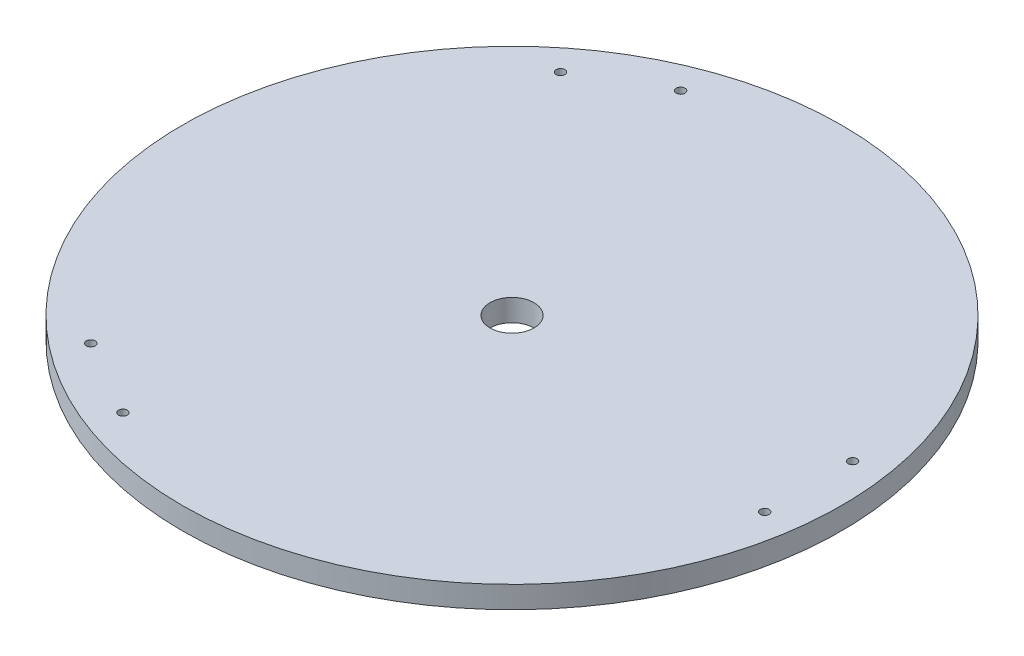
ISO-10303-21;
HEADER;
FILE_DESCRIPTION(('STEP AP214'),'2;1');
FILE_NAME('part.step','',(''),(''),'','','');
FILE_SCHEMA(('AUTOMOTIVE_DESIGN { 1 0 10303 214 1 1 1 1 }'));
ENDSEC;
DATA;
#1=APPLICATION_CONTEXT('core data for automotive mechanical design processes');
#2=APPLICATION_PROTOCOL_DEFINITION('international standard','automotive_design',2000,#1);
#3=PRODUCT_CONTEXT('',#1,'mechanical');
#4=PRODUCT('Part','Part','',(#3));
#5=PRODUCT_RELATED_PRODUCT_CATEGORY('part','',(#4));
#6=PRODUCT_DEFINITION_FORMATION('','',#4);
#7=PRODUCT_DEFINITION_CONTEXT('part definition',#1,'design');
#8=PRODUCT_DEFINITION('design','',#6,#7);
#9=PRODUCT_DEFINITION_SHAPE('','',#8);
#10=(LENGTH_UNIT() NAMED_UNIT(*) SI_UNIT(.MILLI.,.METRE.));
#11=(NAMED_UNIT(*) PLANE_ANGLE_UNIT() SI_UNIT($,.RADIAN.));
#12=(NAMED_UNIT(*) SI_UNIT($,.STERADIAN.) SOLID_ANGLE_UNIT());
#13=UNCERTAINTY_MEASURE_WITH_UNIT(LENGTH_MEASURE(1.E-05),#10,'distance_accuracy_value','');
#14=(GEOMETRIC_REPRESENTATION_CONTEXT(3) GLOBAL_UNCERTAINTY_ASSIGNED_CONTEXT((#13)) GLOBAL_UNIT_ASSIGNED_CONTEXT((#10,
#11,#12)) REPRESENTATION_CONTEXT('',''));
#15=CARTESIAN_POINT('',(0.,0.,0.));
#16=DIRECTION('',(0.,0.,1.));
#17=DIRECTION('',(1.,0.,0.));
#18=AXIS2_PLACEMENT_3D('',#15,#16,#17);
#19=CARTESIAN_POINT('',(0.,10.,0.));
#20=DIRECTION('',(0.,1.,0.));
#21=DIRECTION('',(0.,0.,1.));
#22=AXIS2_PLACEMENT_3D('',#19,#20,#21);
#23=PLANE('',#22);
#24=CARTESIAN_POINT('',(-84.8205080756975,10.,-106.913429510878));
#25=DIRECTION('',(0.,1.,0.));
#26=DIRECTION('',(0.,0.,1.));
#27=AXIS2_PLACEMENT_3D('',#24,#25,#26);
#28=CIRCLE('',#27,2.00000000000803);
#29=CARTESIAN_POINT('',(-84.8205080756975,10.,-104.91342951087));
#30=VERTEX_POINT('',#29);
#31=EDGE_CURVE('E81',#30,#30,#28,.T.);
#32=ORIENTED_EDGE('',*,*,#31,.F.);
#33=EDGE_LOOP('',(#32));
#34=FACE_BOUND('',#33,.T.);
#35=CARTESIAN_POINT('',(-50.179491924297,10.,126.913429510918));
#36=DIRECTION('',(0.,1.,0.));
#37=DIRECTION('',(0.,0.,1.));
#38=AXIS2_PLACEMENT_3D('',#35,#36,#37);
#39=CIRCLE('',#38,1.99999999998532);
#40=CARTESIAN_POINT('',(-50.179491924297,10.,128.913429510903));
#41=VERTEX_POINT('',#40);
#42=EDGE_CURVE('E69',#41,#41,#39,.T.);
#43=ORIENTED_EDGE('',*,*,#42,.F.);
#44=EDGE_LOOP('',(#43));
#45=FACE_BOUND('',#44,.T.);
#46=CARTESIAN_POINT('',(135.,10.,-20.));
#47=DIRECTION('',(0.,1.,0.));
#48=DIRECTION('',(0.,0.,1.));
#49=AXIS2_PLACEMENT_3D('',#46,#47,#48);
#50=CIRCLE('',#49,2.);
#51=CARTESIAN_POINT('',(135.,10.,-18.));
#52=VERTEX_POINT('',#51);
#53=EDGE_CURVE('E57',#52,#52,#50,.T.);
#54=ORIENTED_EDGE('',*,*,#53,.F.);
#55=EDGE_LOOP('',(#54));
#56=FACE_BOUND('',#55,.T.);
#57=CARTESIAN_POINT('',(0.,10.,0.));
#58=DIRECTION('',(0.,1.,0.));
#59=DIRECTION('',(0.,0.,1.));
#60=AXIS2_PLACEMENT_3D('',#57,#58,#59);
#61=CIRCLE('',#60,150.);
#62=CARTESIAN_POINT('',(0.,10.,150.));
#63=VERTEX_POINT('',#62);
#64=EDGE_CURVE('E10',#63,#63,#61,.T.);
#65=ORIENTED_EDGE('',*,*,#64,.T.);
#66=EDGE_LOOP('',(#65));
#67=FACE_BOUND('',#66,.T.);
#68=CARTESIAN_POINT('',(0.,10.,0.));
#69=DIRECTION('',(0.,1.,0.));
#70=DIRECTION('',(0.,0.,1.));
#71=AXIS2_PLACEMENT_3D('',#68,#69,#70);
#72=CIRCLE('',#71,10.);
#73=CARTESIAN_POINT('',(0.,10.,10.));
#74=VERTEX_POINT('',#73);
#75=EDGE_CURVE('E52',#74,#74,#72,.T.);
#76=ORIENTED_EDGE('',*,*,#75,.F.);
#77=EDGE_LOOP('',(#76));
#78=FACE_BOUND('',#77,.T.);
#79=CARTESIAN_POINT('',(135.,10.,20.));
#80=DIRECTION('',(0.,1.,0.));
#81=DIRECTION('',(0.,0.,1.));
#82=AXIS2_PLACEMENT_3D('',#79,#80,#81);
#83=CIRCLE('',#82,2.);
#84=CARTESIAN_POINT('',(135.,10.,22.));
#85=VERTEX_POINT('',#84);
#86=EDGE_CURVE('E63',#85,#85,#83,.T.);
#87=ORIENTED_EDGE('',*,*,#86,.F.);
#88=EDGE_LOOP('',(#87));
#89=FACE_BOUND('',#88,.T.);
#90=CARTESIAN_POINT('',(-84.8205080756745,10.,106.913429510918));
#91=DIRECTION('',(0.,1.,0.));
#92=DIRECTION('',(0.,0.,1.));
#93=AXIS2_PLACEMENT_3D('',#90,#91,#92);
#94=CIRCLE('',#93,1.99999999998514);
#95=CARTESIAN_POINT('',(-84.8205080756745,10.,108.913429510903));
#96=VERTEX_POINT('',#95);
#97=EDGE_CURVE('E75',#96,#96,#94,.T.);
#98=ORIENTED_EDGE('',*,*,#97,.F.);
#99=EDGE_LOOP('',(#98));
#100=FACE_BOUND('',#99,.T.);
#101=CARTESIAN_POINT('',(-50.17949192432,10.,-126.913429510878));
#102=DIRECTION('',(0.,1.,0.));
#103=DIRECTION('',(0.,0.,1.));
#104=AXIS2_PLACEMENT_3D('',#101,#102,#103);
#105=CIRCLE('',#104,2.00000000000764);
#106=CARTESIAN_POINT('',(-50.17949192432,10.,-124.91342951087));
#107=VERTEX_POINT('',#106);
#108=EDGE_CURVE('E87',#107,#107,#105,.T.);
#109=ORIENTED_EDGE('',*,*,#108,.F.);
#110=EDGE_LOOP('',(#109));
#111=FACE_BOUND('',#110,.T.);
#112=ADVANCED_FACE('F41',(#34,#45,#56,#67,#78,#89,#100,#111),#23,.T.);
#113=CARTESIAN_POINT('',(0.,0.,0.));
#114=DIRECTION('',(0.,1.,0.));
#115=DIRECTION('',(0.,0.,1.));
#116=AXIS2_PLACEMENT_3D('',#113,#114,#115);
#117=PLANE('',#116);
#118=CARTESIAN_POINT('',(0.,0.,0.));
#119=DIRECTION('',(0.,1.,0.));
#120=DIRECTION('',(0.,0.,1.));
#121=AXIS2_PLACEMENT_3D('',#118,#119,#120);
#122=CIRCLE('',#121,150.);
#123=CARTESIAN_POINT('',(0.,0.,150.));
#124=VERTEX_POINT('',#123);
#125=EDGE_CURVE('E45',#124,#124,#122,.T.);
#126=ORIENTED_EDGE('',*,*,#125,.F.);
#127=EDGE_LOOP('',(#126));
#128=FACE_BOUND('',#127,.T.);
#129=CARTESIAN_POINT('',(0.,0.,0.));
#130=DIRECTION('',(0.,1.,0.));
#131=DIRECTION('',(0.,0.,1.));
#132=AXIS2_PLACEMENT_3D('',#129,#130,#131);
#133=CIRCLE('',#132,10.);
#134=CARTESIAN_POINT('',(0.,0.,10.));
#135=VERTEX_POINT('',#134);
#136=EDGE_CURVE('E54',#135,#135,#133,.T.);
#137=ORIENTED_EDGE('',*,*,#136,.T.);
#138=EDGE_LOOP('',(#137));
#139=FACE_BOUND('',#138,.T.);
#140=CARTESIAN_POINT('',(135.,0.,-20.));
#141=DIRECTION('',(0.,1.,0.));
#142=DIRECTION('',(0.,0.,1.));
#143=AXIS2_PLACEMENT_3D('',#140,#141,#142);
#144=CIRCLE('',#143,2.);
#145=CARTESIAN_POINT('',(135.,0.,-18.));
#146=VERTEX_POINT('',#145);
#147=EDGE_CURVE('E60',#146,#146,#144,.T.);
#148=ORIENTED_EDGE('',*,*,#147,.T.);
#149=EDGE_LOOP('',(#148));
#150=FACE_BOUND('',#149,.T.);
#151=CARTESIAN_POINT('',(135.,0.,20.));
#152=DIRECTION('',(0.,1.,0.));
#153=DIRECTION('',(0.,0.,1.));
#154=AXIS2_PLACEMENT_3D('',#151,#152,#153);
#155=CIRCLE('',#154,2.);
#156=CARTESIAN_POINT('',(135.,0.,22.));
#157=VERTEX_POINT('',#156);
#158=EDGE_CURVE('E66',#157,#157,#155,.T.);
#159=ORIENTED_EDGE('',*,*,#158,.T.);
#160=EDGE_LOOP('',(#159));
#161=FACE_BOUND('',#160,.T.);
#162=CARTESIAN_POINT('',(-50.179491924297,0.,126.913429510918));
#163=DIRECTION('',(0.,1.,0.));
#164=DIRECTION('',(0.,0.,1.));
#165=AXIS2_PLACEMENT_3D('',#162,#163,#164);
#166=CIRCLE('',#165,1.99999999998532);
#167=CARTESIAN_POINT('',(-50.179491924297,0.,128.913429510903));
#168=VERTEX_POINT('',#167);
#169=EDGE_CURVE('E72',#168,#168,#166,.T.);
#170=ORIENTED_EDGE('',*,*,#169,.T.);
#171=EDGE_LOOP('',(#170));
#172=FACE_BOUND('',#171,.T.);
#173=CARTESIAN_POINT('',(-84.8205080756745,0.,106.913429510918));
#174=DIRECTION('',(0.,1.,0.));
#175=DIRECTION('',(0.,0.,1.));
#176=AXIS2_PLACEMENT_3D('',#173,#174,#175);
#177=CIRCLE('',#176,1.99999999998514);
#178=CARTESIAN_POINT('',(-84.8205080756745,0.,108.913429510903));
#179=VERTEX_POINT('',#178);
#180=EDGE_CURVE('E78',#179,#179,#177,.T.);
#181=ORIENTED_EDGE('',*,*,#180,.T.);
#182=EDGE_LOOP('',(#181));
#183=FACE_BOUND('',#182,.T.);
#184=CARTESIAN_POINT('',(-84.8205080756975,0.,-106.913429510878));
#185=DIRECTION('',(0.,1.,0.));
#186=DIRECTION('',(0.,0.,1.));
#187=AXIS2_PLACEMENT_3D('',#184,#185,#186);
#188=CIRCLE('',#187,2.00000000000803);
#189=CARTESIAN_POINT('',(-84.8205080756975,0.,-104.91342951087));
#190=VERTEX_POINT('',#189);
#191=EDGE_CURVE('E84',#190,#190,#188,.T.);
#192=ORIENTED_EDGE('',*,*,#191,.T.);
#193=EDGE_LOOP('',(#192));
#194=FACE_BOUND('',#193,.T.);
#195=CARTESIAN_POINT('',(-50.17949192432,0.,-126.913429510878));
#196=DIRECTION('',(0.,1.,0.));
#197=DIRECTION('',(0.,0.,1.));
#198=AXIS2_PLACEMENT_3D('',#195,#196,#197);
#199=CIRCLE('',#198,2.00000000000764);
#200=CARTESIAN_POINT('',(-50.17949192432,0.,-124.91342951087));
#201=VERTEX_POINT('',#200);
#202=EDGE_CURVE('E90',#201,#201,#199,.T.);
#203=ORIENTED_EDGE('',*,*,#202,.T.);
#204=EDGE_LOOP('',(#203));
#205=FACE_BOUND('',#204,.T.);
#206=ADVANCED_FACE('F100',(#128,#139,#150,#161,#172,#183,#194,#205),#117,.F.);
#207=CARTESIAN_POINT('',(0.,10.,0.));
#208=DIRECTION('',(0.,-1.,0.));
#209=DIRECTION('',(0.,0.,-1.));
#210=AXIS2_PLACEMENT_3D('',#207,#208,#209);
#211=CYLINDRICAL_SURFACE('',#210,150.);
#212=ORIENTED_EDGE('',*,*,#64,.F.);
#213=EDGE_LOOP('',(#212));
#214=FACE_BOUND('',#213,.T.);
#215=ORIENTED_EDGE('',*,*,#125,.T.);
#216=EDGE_LOOP('',(#215));
#217=FACE_BOUND('',#216,.T.);
#218=ADVANCED_FACE('F43',(#214,#217),#211,.T.);
#219=CARTESIAN_POINT('',(0.,10.,0.));
#220=DIRECTION('',(0.,-1.,0.));
#221=DIRECTION('',(0.,0.,-1.));
#222=AXIS2_PLACEMENT_3D('',#219,#220,#221);
#223=CYLINDRICAL_SURFACE('',#222,10.);
#224=ORIENTED_EDGE('',*,*,#75,.T.);
#225=EDGE_LOOP('',(#224));
#226=FACE_BOUND('',#225,.T.);
#227=ORIENTED_EDGE('',*,*,#136,.F.);
#228=EDGE_LOOP('',(#227));
#229=FACE_BOUND('',#228,.T.);
#230=ADVANCED_FACE('F110',(#226,#229),#223,.F.);
#231=CARTESIAN_POINT('',(135.,10.,-20.));
#232=DIRECTION('',(0.,-1.,0.));
#233=DIRECTION('',(0.,0.,-1.));
#234=AXIS2_PLACEMENT_3D('',#231,#232,#233);
#235=CYLINDRICAL_SURFACE('',#234,2.);
#236=ORIENTED_EDGE('',*,*,#53,.T.);
#237=EDGE_LOOP('',(#236));
#238=FACE_BOUND('',#237,.T.);
#239=ORIENTED_EDGE('',*,*,#147,.F.);
#240=EDGE_LOOP('',(#239));
#241=FACE_BOUND('',#240,.T.);
#242=ADVANCED_FACE('F113',(#238,#241),#235,.F.);
#243=CARTESIAN_POINT('',(135.,10.,20.));
#244=DIRECTION('',(0.,-1.,0.));
#245=DIRECTION('',(0.,0.,-1.));
#246=AXIS2_PLACEMENT_3D('',#243,#244,#245);
#247=CYLINDRICAL_SURFACE('',#246,2.);
#248=ORIENTED_EDGE('',*,*,#86,.T.);
#249=EDGE_LOOP('',(#248));
#250=FACE_BOUND('',#249,.T.);
#251=ORIENTED_EDGE('',*,*,#158,.F.);
#252=EDGE_LOOP('',(#251));
#253=FACE_BOUND('',#252,.T.);
#254=ADVANCED_FACE('F117',(#250,#253),#247,.F.);
#255=CARTESIAN_POINT('',(-50.179491924297,10.,126.913429510918));
#256=DIRECTION('',(0.,-1.,0.));
#257=DIRECTION('',(0.,0.,-1.));
#258=AXIS2_PLACEMENT_3D('',#255,#256,#257);
#259=CYLINDRICAL_SURFACE('',#258,1.99999999998532);
#260=ORIENTED_EDGE('',*,*,#42,.T.);
#261=EDGE_LOOP('',(#260));
#262=FACE_BOUND('',#261,.T.);
#263=ORIENTED_EDGE('',*,*,#169,.F.);
#264=EDGE_LOOP('',(#263));
#265=FACE_BOUND('',#264,.T.);
#266=ADVANCED_FACE('F121',(#262,#265),#259,.F.);
#267=CARTESIAN_POINT('',(-84.8205080756745,10.,106.913429510918));
#268=DIRECTION('',(0.,-1.,0.));
#269=DIRECTION('',(0.,0.,-1.));
#270=AXIS2_PLACEMENT_3D('',#267,#268,#269);
#271=CYLINDRICAL_SURFACE('',#270,1.99999999998514);
#272=ORIENTED_EDGE('',*,*,#97,.T.);
#273=EDGE_LOOP('',(#272));
#274=FACE_BOUND('',#273,.T.);
#275=ORIENTED_EDGE('',*,*,#180,.F.);
#276=EDGE_LOOP('',(#275));
#277=FACE_BOUND('',#276,.T.);
#278=ADVANCED_FACE('F125',(#274,#277),#271,.F.);
#279=CARTESIAN_POINT('',(-84.8205080756975,10.,-106.913429510878));
#280=DIRECTION('',(0.,-1.,0.));
#281=DIRECTION('',(0.,0.,-1.));
#282=AXIS2_PLACEMENT_3D('',#279,#280,#281);
#283=CYLINDRICAL_SURFACE('',#282,2.00000000000803);
#284=ORIENTED_EDGE('',*,*,#31,.T.);
#285=EDGE_LOOP('',(#284));
#286=FACE_BOUND('',#285,.T.);
#287=ORIENTED_EDGE('',*,*,#191,.F.);
#288=EDGE_LOOP('',(#287));
#289=FACE_BOUND('',#288,.T.);
#290=ADVANCED_FACE('F129',(#286,#289),#283,.F.);
#291=CARTESIAN_POINT('',(-50.17949192432,10.,-126.913429510878));
#292=DIRECTION('',(0.,-1.,0.));
#293=DIRECTION('',(0.,0.,-1.));
#294=AXIS2_PLACEMENT_3D('',#291,#292,#293);
#295=CYLINDRICAL_SURFACE('',#294,2.00000000000764);
#296=ORIENTED_EDGE('',*,*,#108,.T.);
#297=EDGE_LOOP('',(#296));
#298=FACE_BOUND('',#297,.T.);
#299=ORIENTED_EDGE('',*,*,#202,.F.);
#300=EDGE_LOOP('',(#299));
#301=FACE_BOUND('',#300,.T.);
#302=ADVANCED_FACE('F96',(#298,#301),#295,.F.);
#303=CLOSED_SHELL('',(#112,#206,#218,#230,#242,#254,#266,#278,#290,#302));
#304=MANIFOLD_SOLID_BREP('B2',#303);
#305=ADVANCED_BREP_SHAPE_REPRESENTATION('',(#18,#304),#14);
#306=SHAPE_DEFINITION_REPRESENTATION(#9,#305);
ENDSEC;
END-ISO-10303-21;
